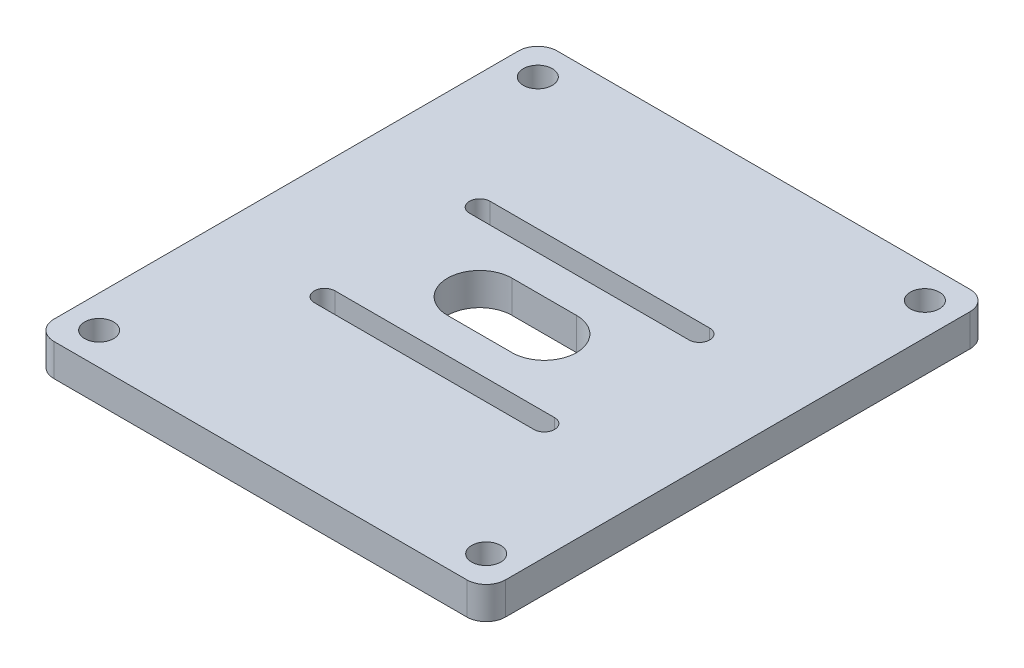
ISO-10303-21;
HEADER;
FILE_DESCRIPTION(('STEP AP214'),'2;1');
FILE_NAME('part.step','',(''),(''),'','','');
FILE_SCHEMA(('AUTOMOTIVE_DESIGN { 1 0 10303 214 1 1 1 1 }'));
ENDSEC;
DATA;
#1=APPLICATION_CONTEXT('core data for automotive mechanical design processes');
#2=APPLICATION_PROTOCOL_DEFINITION('international standard','automotive_design',2000,#1);
#3=PRODUCT_CONTEXT('',#1,'mechanical');
#4=PRODUCT('Part','Part','',(#3));
#5=PRODUCT_RELATED_PRODUCT_CATEGORY('part','',(#4));
#6=PRODUCT_DEFINITION_FORMATION('','',#4);
#7=PRODUCT_DEFINITION_CONTEXT('part definition',#1,'design');
#8=PRODUCT_DEFINITION('design','',#6,#7);
#9=PRODUCT_DEFINITION_SHAPE('','',#8);
#10=(LENGTH_UNIT() NAMED_UNIT(*) SI_UNIT(.MILLI.,.METRE.));
#11=(NAMED_UNIT(*) PLANE_ANGLE_UNIT() SI_UNIT($,.RADIAN.));
#12=(NAMED_UNIT(*) SI_UNIT($,.STERADIAN.) SOLID_ANGLE_UNIT());
#13=UNCERTAINTY_MEASURE_WITH_UNIT(LENGTH_MEASURE(1.E-05),#10,'distance_accuracy_value','');
#14=(GEOMETRIC_REPRESENTATION_CONTEXT(3) GLOBAL_UNCERTAINTY_ASSIGNED_CONTEXT((#13)) GLOBAL_UNIT_ASSIGNED_CONTEXT((#10,
#11,#12)) REPRESENTATION_CONTEXT('',''));
#15=CARTESIAN_POINT('',(0.,0.,0.));
#16=DIRECTION('',(0.,0.,1.));
#17=DIRECTION('',(1.,0.,0.));
#18=AXIS2_PLACEMENT_3D('',#15,#16,#17);
#19=CARTESIAN_POINT('',(0.,5.,10.4208152801713));
#20=DIRECTION('',(0.,0.,-1.));
#21=DIRECTION('',(-1.,0.,0.));
#22=AXIS2_PLACEMENT_3D('',#19,#20,#21);
#23=PLANE('',#22);
#24=DIRECTION('',(1.,0.,0.));
#25=VECTOR('',#24,1.);
#26=CARTESIAN_POINT('',(0.,0.,10.4208152801713));
#27=LINE('',#26,#25);
#28=CARTESIAN_POINT('',(-22.0208152801713,0.,10.4208152801713));
#29=VERTEX_POINT('',#28);
#30=CARTESIAN_POINT('',(12.0208152801713,0.,10.4208152801713));
#31=VERTEX_POINT('',#30);
#32=EDGE_CURVE('E321',#29,#31,#27,.T.);
#33=ORIENTED_EDGE('',*,*,#32,.T.);
#34=DIRECTION('',(0.,-1.,0.));
#35=VECTOR('',#34,1.);
#36=CARTESIAN_POINT('',(12.0208152801713,5.,10.4208152801713));
#37=LINE('',#36,#35);
#38=CARTESIAN_POINT('',(12.0208152801713,5.,10.4208152801713));
#39=VERTEX_POINT('',#38);
#40=EDGE_CURVE('E356',#39,#31,#37,.T.);
#41=ORIENTED_EDGE('',*,*,#40,.F.);
#42=DIRECTION('',(1.,0.,0.));
#43=VECTOR('',#42,1.);
#44=CARTESIAN_POINT('',(0.,5.,10.4208152801713));
#45=LINE('',#44,#43);
#46=CARTESIAN_POINT('',(-22.0208152801713,5.,10.4208152801713));
#47=VERTEX_POINT('',#46);
#48=EDGE_CURVE('E245',#47,#39,#45,.T.);
#49=ORIENTED_EDGE('',*,*,#48,.F.);
#50=DIRECTION('',(0.,-1.,0.));
#51=VECTOR('',#50,1.);
#52=CARTESIAN_POINT('',(-22.0208152801713,5.,10.4208152801713));
#53=LINE('',#52,#51);
#54=EDGE_CURVE('E345',#47,#29,#53,.T.);
#55=ORIENTED_EDGE('',*,*,#54,.T.);
#56=EDGE_LOOP('',(#33,#41,#49,#55));
#57=FACE_BOUND('',#56,.T.);
#58=ADVANCED_FACE('F39',(#57),#23,.F.);
#59=CARTESIAN_POINT('',(12.0208152801713,5.,12.0208152801713));
#60=DIRECTION('',(0.,-1.,0.));
#61=DIRECTION('',(0.,0.,-1.));
#62=AXIS2_PLACEMENT_3D('',#59,#60,#61);
#63=CYLINDRICAL_SURFACE('',#62,1.6);
#64=CARTESIAN_POINT('',(12.0208152801713,0.,12.0208152801713));
#65=DIRECTION('',(0.,1.,0.));
#66=DIRECTION('',(0.,0.,1.));
#67=AXIS2_PLACEMENT_3D('',#64,#65,#66);
#68=CIRCLE('',#67,1.6);
#69=CARTESIAN_POINT('',(12.0208152801713,0.,13.6208152801713));
#70=VERTEX_POINT('',#69);
#71=EDGE_CURVE('E325',#31,#70,#68,.F.);
#72=ORIENTED_EDGE('',*,*,#71,.T.);
#73=DIRECTION('',(0.,-1.,0.));
#74=VECTOR('',#73,1.);
#75=CARTESIAN_POINT('',(12.0208152801713,5.,13.6208152801713));
#76=LINE('',#75,#74);
#77=CARTESIAN_POINT('',(12.0208152801713,5.,13.6208152801713));
#78=VERTEX_POINT('',#77);
#79=EDGE_CURVE('E353',#78,#70,#76,.T.);
#80=ORIENTED_EDGE('',*,*,#79,.F.);
#81=CARTESIAN_POINT('',(12.0208152801713,5.,12.0208152801713));
#82=DIRECTION('',(0.,1.,0.));
#83=DIRECTION('',(0.,0.,1.));
#84=AXIS2_PLACEMENT_3D('',#81,#82,#83);
#85=CIRCLE('',#84,1.6);
#86=EDGE_CURVE('E249',#39,#78,#85,.F.);
#87=ORIENTED_EDGE('',*,*,#86,.F.);
#88=ORIENTED_EDGE('',*,*,#40,.T.);
#89=EDGE_LOOP('',(#72,#80,#87,#88));
#90=FACE_BOUND('',#89,.T.);
#91=ADVANCED_FACE('F461',(#90),#63,.F.);
#92=CARTESIAN_POINT('',(0.,5.,13.6208152801713));
#93=DIRECTION('',(0.,0.,-1.));
#94=DIRECTION('',(-1.,0.,0.));
#95=AXIS2_PLACEMENT_3D('',#92,#93,#94);
#96=PLANE('',#95);
#97=DIRECTION('',(1.,0.,0.));
#98=VECTOR('',#97,1.);
#99=CARTESIAN_POINT('',(0.,0.,13.6208152801713));
#100=LINE('',#99,#98);
#101=CARTESIAN_POINT('',(-22.0208152801713,0.,13.6208152801713));
#102=VERTEX_POINT('',#101);
#103=EDGE_CURVE('E329',#102,#70,#100,.T.);
#104=ORIENTED_EDGE('',*,*,#103,.F.);
#105=DIRECTION('',(0.,-1.,0.));
#106=VECTOR('',#105,1.);
#107=CARTESIAN_POINT('',(-22.0208152801713,5.,13.6208152801713));
#108=LINE('',#107,#106);
#109=CARTESIAN_POINT('',(-22.0208152801713,5.,13.6208152801713));
#110=VERTEX_POINT('',#109);
#111=EDGE_CURVE('E349',#110,#102,#108,.T.);
#112=ORIENTED_EDGE('',*,*,#111,.F.);
#113=DIRECTION('',(1.,0.,0.));
#114=VECTOR('',#113,1.);
#115=CARTESIAN_POINT('',(0.,5.,13.6208152801713));
#116=LINE('',#115,#114);
#117=EDGE_CURVE('E252',#110,#78,#116,.T.);
#118=ORIENTED_EDGE('',*,*,#117,.T.);
#119=ORIENTED_EDGE('',*,*,#79,.T.);
#120=EDGE_LOOP('',(#104,#112,#118,#119));
#121=FACE_BOUND('',#120,.T.);
#122=ADVANCED_FACE('F467',(#121),#96,.T.);
#123=CARTESIAN_POINT('',(0.,5.,-39.));
#124=DIRECTION('',(0.,0.,-1.));
#125=DIRECTION('',(-1.,0.,0.));
#126=AXIS2_PLACEMENT_3D('',#123,#124,#125);
#127=PLANE('',#126);
#128=DIRECTION('',(1.,0.,0.));
#129=VECTOR('',#128,1.);
#130=CARTESIAN_POINT('',(0.,5.,-39.));
#131=LINE('',#130,#129);
#132=CARTESIAN_POINT('',(-37.,5.,-39.));
#133=VERTEX_POINT('',#132);
#134=CARTESIAN_POINT('',(27.,5.,-39.));
#135=VERTEX_POINT('',#134);
#136=EDGE_CURVE('E231',#133,#135,#131,.T.);
#137=ORIENTED_EDGE('',*,*,#136,.T.);
#138=DIRECTION('',(0.,-1.,0.));
#139=VECTOR('',#138,1.);
#140=CARTESIAN_POINT('',(27.,5.,-39.));
#141=LINE('',#140,#139);
#142=CARTESIAN_POINT('',(27.,0.,-39.));
#143=VERTEX_POINT('',#142);
#144=EDGE_CURVE('E11',#135,#143,#141,.T.);
#145=ORIENTED_EDGE('',*,*,#144,.T.);
#146=DIRECTION('',(1.,0.,0.));
#147=VECTOR('',#146,1.);
#148=CARTESIAN_POINT('',(0.,0.,-39.));
#149=LINE('',#148,#147);
#150=CARTESIAN_POINT('',(-37.,0.,-39.));
#151=VERTEX_POINT('',#150);
#152=EDGE_CURVE('E305',#151,#143,#149,.T.);
#153=ORIENTED_EDGE('',*,*,#152,.F.);
#154=DIRECTION('',(0.,-1.,0.));
#155=VECTOR('',#154,1.);
#156=CARTESIAN_POINT('',(-37.,5.,-39.));
#157=LINE('',#156,#155);
#158=EDGE_CURVE('E48',#151,#133,#157,.F.);
#159=ORIENTED_EDGE('',*,*,#158,.T.);
#160=EDGE_LOOP('',(#137,#145,#153,#159));
#161=FACE_BOUND('',#160,.T.);
#162=ADVANCED_FACE('F424',(#161),#127,.T.);
#163=CARTESIAN_POINT('',(-40.,5.,0.));
#164=DIRECTION('',(1.,0.,0.));
#165=DIRECTION('',(0.,0.,-1.));
#166=AXIS2_PLACEMENT_3D('',#163,#164,#165);
#167=PLANE('',#166);
#168=DIRECTION('',(0.,0.,1.));
#169=VECTOR('',#168,1.);
#170=CARTESIAN_POINT('',(-40.,0.,0.));
#171=LINE('',#170,#169);
#172=CARTESIAN_POINT('',(-40.,0.,-36.));
#173=VERTEX_POINT('',#172);
#174=CARTESIAN_POINT('',(-40.,0.,36.));
#175=VERTEX_POINT('',#174);
#176=EDGE_CURVE('E309',#173,#175,#171,.T.);
#177=ORIENTED_EDGE('',*,*,#176,.T.);
#178=DIRECTION('',(0.,-1.,0.));
#179=VECTOR('',#178,1.);
#180=CARTESIAN_POINT('',(-40.,5.,36.));
#181=LINE('',#180,#179);
#182=CARTESIAN_POINT('',(-40.,5.,36.));
#183=VERTEX_POINT('',#182);
#184=EDGE_CURVE('E400',#175,#183,#181,.F.);
#185=ORIENTED_EDGE('',*,*,#184,.T.);
#186=DIRECTION('',(0.,0.,1.));
#187=VECTOR('',#186,1.);
#188=CARTESIAN_POINT('',(-40.,5.,0.));
#189=LINE('',#188,#187);
#190=CARTESIAN_POINT('',(-40.,5.,-36.));
#191=VERTEX_POINT('',#190);
#192=EDGE_CURVE('E235',#191,#183,#189,.T.);
#193=ORIENTED_EDGE('',*,*,#192,.F.);
#194=DIRECTION('',(0.,-1.,0.));
#195=VECTOR('',#194,1.);
#196=CARTESIAN_POINT('',(-40.,0.,-36.));
#197=LINE('',#196,#195);
#198=EDGE_CURVE('E396',#191,#173,#197,.T.);
#199=ORIENTED_EDGE('',*,*,#198,.T.);
#200=EDGE_LOOP('',(#177,#185,#193,#199));
#201=FACE_BOUND('',#200,.T.);
#202=ADVANCED_FACE('F434',(#201),#167,.F.);
#203=CARTESIAN_POINT('',(0.,5.,39.));
#204=DIRECTION('',(0.,0.,-1.));
#205=DIRECTION('',(-1.,0.,0.));
#206=AXIS2_PLACEMENT_3D('',#203,#204,#205);
#207=PLANE('',#206);
#208=DIRECTION('',(1.,0.,0.));
#209=VECTOR('',#208,1.);
#210=CARTESIAN_POINT('',(0.,5.,39.));
#211=LINE('',#210,#209);
#212=CARTESIAN_POINT('',(-37.,5.,39.));
#213=VERTEX_POINT('',#212);
#214=CARTESIAN_POINT('',(27.,5.,39.));
#215=VERTEX_POINT('',#214);
#216=EDGE_CURVE('E239',#213,#215,#211,.T.);
#217=ORIENTED_EDGE('',*,*,#216,.F.);
#218=DIRECTION('',(0.,-1.,0.));
#219=VECTOR('',#218,1.);
#220=CARTESIAN_POINT('',(-37.,5.,39.));
#221=LINE('',#220,#219);
#222=CARTESIAN_POINT('',(-37.,0.,39.));
#223=VERTEX_POINT('',#222);
#224=EDGE_CURVE('E380',#213,#223,#221,.T.);
#225=ORIENTED_EDGE('',*,*,#224,.T.);
#226=DIRECTION('',(1.,0.,0.));
#227=VECTOR('',#226,1.);
#228=CARTESIAN_POINT('',(0.,0.,39.));
#229=LINE('',#228,#227);
#230=CARTESIAN_POINT('',(27.,0.,39.));
#231=VERTEX_POINT('',#230);
#232=EDGE_CURVE('E313',#223,#231,#229,.T.);
#233=ORIENTED_EDGE('',*,*,#232,.T.);
#234=DIRECTION('',(0.,-1.,0.));
#235=VECTOR('',#234,1.);
#236=CARTESIAN_POINT('',(27.,5.,39.));
#237=LINE('',#236,#235);
#238=EDGE_CURVE('E360',#231,#215,#237,.F.);
#239=ORIENTED_EDGE('',*,*,#238,.T.);
#240=EDGE_LOOP('',(#217,#225,#233,#239));
#241=FACE_BOUND('',#240,.T.);
#242=ADVANCED_FACE('F446',(#241),#207,.F.);
#243=CARTESIAN_POINT('',(12.0208152801713,5.,-12.0208152801713));
#244=DIRECTION('',(0.,-1.,0.));
#245=DIRECTION('',(0.,0.,-1.));
#246=AXIS2_PLACEMENT_3D('',#243,#244,#245);
#247=CYLINDRICAL_SURFACE('',#246,1.6);
#248=CARTESIAN_POINT('',(12.0208152801713,0.,-12.0208152801713));
#249=DIRECTION('',(0.,1.,0.));
#250=DIRECTION('',(0.,0.,1.));
#251=AXIS2_PLACEMENT_3D('',#248,#249,#250);
#252=CIRCLE('',#251,1.6);
#253=CARTESIAN_POINT('',(12.0208152801713,0.,-10.4208152801713));
#254=VERTEX_POINT('',#253);
#255=CARTESIAN_POINT('',(12.0208152801713,0.,-13.6208152801713));
#256=VERTEX_POINT('',#255);
#257=EDGE_CURVE('E289',#254,#256,#252,.T.);
#258=ORIENTED_EDGE('',*,*,#257,.F.);
#259=DIRECTION('',(0.,-1.,0.));
#260=VECTOR('',#259,1.);
#261=CARTESIAN_POINT('',(12.0208152801713,5.,-10.4208152801713));
#262=LINE('',#261,#260);
#263=CARTESIAN_POINT('',(12.0208152801713,5.,-10.4208152801713));
#264=VERTEX_POINT('',#263);
#265=EDGE_CURVE('E350',#264,#254,#262,.T.);
#266=ORIENTED_EDGE('',*,*,#265,.F.);
#267=CARTESIAN_POINT('',(12.0208152801713,5.,-12.0208152801713));
#268=DIRECTION('',(0.,1.,0.));
#269=DIRECTION('',(0.,0.,1.));
#270=AXIS2_PLACEMENT_3D('',#267,#268,#269);
#271=CIRCLE('',#270,1.6);
#272=CARTESIAN_POINT('',(12.0208152801713,5.,-13.6208152801713));
#273=VERTEX_POINT('',#272);
#274=EDGE_CURVE('E216',#264,#273,#271,.T.);
#275=ORIENTED_EDGE('',*,*,#274,.T.);
#276=DIRECTION('',(0.,-1.,0.));
#277=VECTOR('',#276,1.);
#278=CARTESIAN_POINT('',(12.0208152801713,5.,-13.6208152801713));
#279=LINE('',#278,#277);
#280=EDGE_CURVE('E190',#273,#256,#279,.T.);
#281=ORIENTED_EDGE('',*,*,#280,.T.);
#282=EDGE_LOOP('',(#258,#266,#275,#281));
#283=FACE_BOUND('',#282,.T.);
#284=ADVANCED_FACE('F478',(#283),#247,.F.);
#285=CARTESIAN_POINT('',(0.,5.,-10.4208152801713));
#286=DIRECTION('',(0.,0.,-1.));
#287=DIRECTION('',(-1.,0.,0.));
#288=AXIS2_PLACEMENT_3D('',#285,#286,#287);
#289=PLANE('',#288);
#290=DIRECTION('',(1.,0.,0.));
#291=VECTOR('',#290,1.);
#292=CARTESIAN_POINT('',(0.,0.,-10.4208152801713));
#293=LINE('',#292,#291);
#294=CARTESIAN_POINT('',(-22.0208152801713,0.,-10.4208152801713));
#295=VERTEX_POINT('',#294);
#296=EDGE_CURVE('E293',#295,#254,#293,.T.);
#297=ORIENTED_EDGE('',*,*,#296,.F.);
#298=DIRECTION('',(0.,-1.,0.));
#299=VECTOR('',#298,1.);
#300=CARTESIAN_POINT('',(-22.0208152801713,5.,-10.4208152801713));
#301=LINE('',#300,#299);
#302=CARTESIAN_POINT('',(-22.0208152801713,5.,-10.4208152801713));
#303=VERTEX_POINT('',#302);
#304=EDGE_CURVE('E366',#303,#295,#301,.T.);
#305=ORIENTED_EDGE('',*,*,#304,.F.);
#306=DIRECTION('',(1.,0.,0.));
#307=VECTOR('',#306,1.);
#308=CARTESIAN_POINT('',(0.,5.,-10.4208152801713));
#309=LINE('',#308,#307);
#310=EDGE_CURVE('E220',#303,#264,#309,.T.);
#311=ORIENTED_EDGE('',*,*,#310,.T.);
#312=ORIENTED_EDGE('',*,*,#265,.T.);
#313=EDGE_LOOP('',(#297,#305,#311,#312));
#314=FACE_BOUND('',#313,.T.);
#315=ADVANCED_FACE('F490',(#314),#289,.T.);
#316=CARTESIAN_POINT('',(-22.0208152801713,5.,-12.0208152801713));
#317=DIRECTION('',(0.,-1.,0.));
#318=DIRECTION('',(0.,0.,-1.));
#319=AXIS2_PLACEMENT_3D('',#316,#317,#318);
#320=CYLINDRICAL_SURFACE('',#319,1.6);
#321=CARTESIAN_POINT('',(-22.0208152801713,0.,-12.0208152801713));
#322=DIRECTION('',(0.,1.,0.));
#323=DIRECTION('',(0.,0.,1.));
#324=AXIS2_PLACEMENT_3D('',#321,#322,#323);
#325=CIRCLE('',#324,1.6);
#326=CARTESIAN_POINT('',(-22.0208152801713,0.,-13.6208152801713));
#327=VERTEX_POINT('',#326);
#328=EDGE_CURVE('E297',#327,#295,#325,.T.);
#329=ORIENTED_EDGE('',*,*,#328,.F.);
#330=DIRECTION('',(0.,-1.,0.));
#331=VECTOR('',#330,1.);
#332=CARTESIAN_POINT('',(-22.0208152801713,5.,-13.6208152801713));
#333=LINE('',#332,#331);
#334=CARTESIAN_POINT('',(-22.0208152801713,5.,-13.6208152801713));
#335=VERTEX_POINT('',#334);
#336=EDGE_CURVE('E363',#335,#327,#333,.T.);
#337=ORIENTED_EDGE('',*,*,#336,.F.);
#338=CARTESIAN_POINT('',(-22.0208152801713,5.,-12.0208152801713));
#339=DIRECTION('',(0.,1.,0.));
#340=DIRECTION('',(0.,0.,1.));
#341=AXIS2_PLACEMENT_3D('',#338,#339,#340);
#342=CIRCLE('',#341,1.6);
#343=EDGE_CURVE('E224',#335,#303,#342,.T.);
#344=ORIENTED_EDGE('',*,*,#343,.T.);
#345=ORIENTED_EDGE('',*,*,#304,.T.);
#346=EDGE_LOOP('',(#329,#337,#344,#345));
#347=FACE_BOUND('',#346,.T.);
#348=ADVANCED_FACE('F487',(#347),#320,.F.);
#349=CARTESIAN_POINT('',(0.,5.,0.));
#350=DIRECTION('',(0.,-1.,0.));
#351=DIRECTION('',(0.,0.,-1.));
#352=AXIS2_PLACEMENT_3D('',#349,#350,#351);
#353=CYLINDRICAL_SURFACE('',#352,5.);
#354=CARTESIAN_POINT('',(0.,0.,0.));
#355=DIRECTION('',(0.,1.,0.));
#356=DIRECTION('',(0.,0.,1.));
#357=AXIS2_PLACEMENT_3D('',#354,#355,#356);
#358=CIRCLE('',#357,5.);
#359=CARTESIAN_POINT('',(0.,0.,5.));
#360=VERTEX_POINT('',#359);
#361=CARTESIAN_POINT('',(0.,0.,-5.));
#362=VERTEX_POINT('',#361);
#363=EDGE_CURVE('E184',#360,#362,#358,.T.);
#364=ORIENTED_EDGE('',*,*,#363,.F.);
#365=DIRECTION('',(0.,-1.,0.));
#366=VECTOR('',#365,1.);
#367=CARTESIAN_POINT('',(0.,5.,5.));
#368=LINE('',#367,#366);
#369=CARTESIAN_POINT('',(0.,5.,5.));
#370=VERTEX_POINT('',#369);
#371=EDGE_CURVE('E179',#370,#360,#368,.T.);
#372=ORIENTED_EDGE('',*,*,#371,.F.);
#373=CARTESIAN_POINT('',(0.,5.,0.));
#374=DIRECTION('',(0.,1.,0.));
#375=DIRECTION('',(0.,0.,1.));
#376=AXIS2_PLACEMENT_3D('',#373,#374,#375);
#377=CIRCLE('',#376,5.);
#378=CARTESIAN_POINT('',(0.,5.,-5.));
#379=VERTEX_POINT('',#378);
#380=EDGE_CURVE('E182',#370,#379,#377,.T.);
#381=ORIENTED_EDGE('',*,*,#380,.T.);
#382=DIRECTION('',(0.,-1.,0.));
#383=VECTOR('',#382,1.);
#384=CARTESIAN_POINT('',(0.,5.,-5.));
#385=LINE('',#384,#383);
#386=EDGE_CURVE('E267',#379,#362,#385,.T.);
#387=ORIENTED_EDGE('',*,*,#386,.T.);
#388=EDGE_LOOP('',(#364,#372,#381,#387));
#389=FACE_BOUND('',#388,.T.);
#390=ADVANCED_FACE('F181',(#389),#353,.F.);
#391=CARTESIAN_POINT('',(0.,5.,5.));
#392=DIRECTION('',(0.,0.,-1.));
#393=DIRECTION('',(-1.,0.,0.));
#394=AXIS2_PLACEMENT_3D('',#391,#392,#393);
#395=PLANE('',#394);
#396=DIRECTION('',(1.,0.,0.));
#397=VECTOR('',#396,1.);
#398=CARTESIAN_POINT('',(0.,0.,5.));
#399=LINE('',#398,#397);
#400=CARTESIAN_POINT('',(-10.,0.,5.));
#401=VERTEX_POINT('',#400);
#402=EDGE_CURVE('E278',#401,#360,#399,.T.);
#403=ORIENTED_EDGE('',*,*,#402,.F.);
#404=DIRECTION('',(0.,-1.,0.));
#405=VECTOR('',#404,1.);
#406=CARTESIAN_POINT('',(-10.,5.,5.));
#407=LINE('',#406,#405);
#408=CARTESIAN_POINT('',(-10.,5.,5.));
#409=VERTEX_POINT('',#408);
#410=EDGE_CURVE('E191',#409,#401,#407,.T.);
#411=ORIENTED_EDGE('',*,*,#410,.F.);
#412=DIRECTION('',(1.,0.,0.));
#413=VECTOR('',#412,1.);
#414=CARTESIAN_POINT('',(0.,5.,5.));
#415=LINE('',#414,#413);
#416=EDGE_CURVE('E198',#409,#370,#415,.T.);
#417=ORIENTED_EDGE('',*,*,#416,.T.);
#418=ORIENTED_EDGE('',*,*,#371,.T.);
#419=EDGE_LOOP('',(#403,#411,#417,#418));
#420=FACE_BOUND('',#419,.T.);
#421=ADVANCED_FACE('F206',(#420),#395,.T.);
#422=CARTESIAN_POINT('',(-10.,5.,0.));
#423=DIRECTION('',(0.,-1.,0.));
#424=DIRECTION('',(0.,0.,-1.));
#425=AXIS2_PLACEMENT_3D('',#422,#423,#424);
#426=CYLINDRICAL_SURFACE('',#425,5.);
#427=CARTESIAN_POINT('',(-10.,0.,0.));
#428=DIRECTION('',(0.,1.,0.));
#429=DIRECTION('',(0.,0.,1.));
#430=AXIS2_PLACEMENT_3D('',#427,#428,#429);
#431=CIRCLE('',#430,5.);
#432=CARTESIAN_POINT('',(-10.,0.,-5.));
#433=VERTEX_POINT('',#432);
#434=EDGE_CURVE('E281',#433,#401,#431,.T.);
#435=ORIENTED_EDGE('',*,*,#434,.F.);
#436=DIRECTION('',(0.,-1.,0.));
#437=VECTOR('',#436,1.);
#438=CARTESIAN_POINT('',(-10.,5.,-5.));
#439=LINE('',#438,#437);
#440=CARTESIAN_POINT('',(-10.,5.,-5.));
#441=VERTEX_POINT('',#440);
#442=EDGE_CURVE('E373',#441,#433,#439,.T.);
#443=ORIENTED_EDGE('',*,*,#442,.F.);
#444=CARTESIAN_POINT('',(-10.,5.,0.));
#445=DIRECTION('',(0.,1.,0.));
#446=DIRECTION('',(0.,0.,1.));
#447=AXIS2_PLACEMENT_3D('',#444,#445,#446);
#448=CIRCLE('',#447,5.);
#449=EDGE_CURVE('E208',#441,#409,#448,.T.);
#450=ORIENTED_EDGE('',*,*,#449,.T.);
#451=ORIENTED_EDGE('',*,*,#410,.T.);
#452=EDGE_LOOP('',(#435,#443,#450,#451));
#453=FACE_BOUND('',#452,.T.);
#454=ADVANCED_FACE('F502',(#453),#426,.F.);
#455=CARTESIAN_POINT('',(25.,5.,34.));
#456=DIRECTION('',(0.,-1.,0.));
#457=DIRECTION('',(0.,0.,-1.));
#458=AXIS2_PLACEMENT_3D('',#455,#456,#457);
#459=CYLINDRICAL_SURFACE('',#458,2.25);
#460=CARTESIAN_POINT('',(25.,5.,34.));
#461=DIRECTION('',(0.,1.,0.));
#462=DIRECTION('',(0.,0.,1.));
#463=AXIS2_PLACEMENT_3D('',#460,#461,#462);
#464=CIRCLE('',#463,2.25);
#465=CARTESIAN_POINT('',(25.,5.,36.25));
#466=VERTEX_POINT('',#465);
#467=EDGE_CURVE('E259',#466,#466,#464,.T.);
#468=ORIENTED_EDGE('',*,*,#467,.T.);
#469=EDGE_LOOP('',(#468));
#470=FACE_BOUND('',#469,.T.);
#471=CARTESIAN_POINT('',(25.,0.,34.));
#472=DIRECTION('',(0.,1.,0.));
#473=DIRECTION('',(0.,0.,1.));
#474=AXIS2_PLACEMENT_3D('',#471,#472,#473);
#475=CIRCLE('',#474,2.25);
#476=CARTESIAN_POINT('',(25.,0.,36.25));
#477=VERTEX_POINT('',#476);
#478=EDGE_CURVE('E336',#477,#477,#475,.T.);
#479=ORIENTED_EDGE('',*,*,#478,.F.);
#480=EDGE_LOOP('',(#479));
#481=FACE_BOUND('',#480,.T.);
#482=ADVANCED_FACE('F505',(#470,#481),#459,.F.);
#483=CARTESIAN_POINT('',(-22.0208152801713,5.,12.0208152801713));
#484=DIRECTION('',(0.,-1.,0.));
#485=DIRECTION('',(0.,0.,-1.));
#486=AXIS2_PLACEMENT_3D('',#483,#484,#485);
#487=CYLINDRICAL_SURFACE('',#486,1.6);
#488=CARTESIAN_POINT('',(-22.0208152801713,0.,12.0208152801713));
#489=DIRECTION('',(0.,1.,0.));
#490=DIRECTION('',(0.,0.,1.));
#491=AXIS2_PLACEMENT_3D('',#488,#489,#490);
#492=CIRCLE('',#491,1.6);
#493=EDGE_CURVE('E333',#102,#29,#492,.F.);
#494=ORIENTED_EDGE('',*,*,#493,.T.);
#495=ORIENTED_EDGE('',*,*,#54,.F.);
#496=CARTESIAN_POINT('',(-22.0208152801713,5.,12.0208152801713));
#497=DIRECTION('',(0.,1.,0.));
#498=DIRECTION('',(0.,0.,1.));
#499=AXIS2_PLACEMENT_3D('',#496,#497,#498);
#500=CIRCLE('',#499,1.6);
#501=EDGE_CURVE('E256',#110,#47,#500,.F.);
#502=ORIENTED_EDGE('',*,*,#501,.F.);
#503=ORIENTED_EDGE('',*,*,#111,.T.);
#504=EDGE_LOOP('',(#494,#495,#502,#503));
#505=FACE_BOUND('',#504,.T.);
#506=ADVANCED_FACE('F475',(#505),#487,.F.);
#507=CARTESIAN_POINT('',(30.,5.,0.));
#508=DIRECTION('',(1.,0.,0.));
#509=DIRECTION('',(0.,0.,-1.));
#510=AXIS2_PLACEMENT_3D('',#507,#508,#509);
#511=PLANE('',#510);
#512=DIRECTION('',(0.,0.,1.));
#513=VECTOR('',#512,1.);
#514=CARTESIAN_POINT('',(30.,5.,0.));
#515=LINE('',#514,#513);
#516=CARTESIAN_POINT('',(30.,5.,-36.));
#517=VERTEX_POINT('',#516);
#518=CARTESIAN_POINT('',(30.,5.,36.));
#519=VERTEX_POINT('',#518);
#520=EDGE_CURVE('E242',#517,#519,#515,.T.);
#521=ORIENTED_EDGE('',*,*,#520,.T.);
#522=DIRECTION('',(0.,-1.,0.));
#523=VECTOR('',#522,1.);
#524=CARTESIAN_POINT('',(30.,0.,36.));
#525=LINE('',#524,#523);
#526=CARTESIAN_POINT('',(30.,0.,36.));
#527=VERTEX_POINT('',#526);
#528=EDGE_CURVE('E416',#519,#527,#525,.T.);
#529=ORIENTED_EDGE('',*,*,#528,.T.);
#530=DIRECTION('',(0.,0.,1.));
#531=VECTOR('',#530,1.);
#532=CARTESIAN_POINT('',(30.,0.,0.));
#533=LINE('',#532,#531);
#534=CARTESIAN_POINT('',(30.,0.,-36.));
#535=VERTEX_POINT('',#534);
#536=EDGE_CURVE('E317',#535,#527,#533,.T.);
#537=ORIENTED_EDGE('',*,*,#536,.F.);
#538=DIRECTION('',(0.,-1.,0.));
#539=VECTOR('',#538,1.);
#540=CARTESIAN_POINT('',(30.,5.,-36.));
#541=LINE('',#540,#539);
#542=EDGE_CURVE('E62',#535,#517,#541,.F.);
#543=ORIENTED_EDGE('',*,*,#542,.T.);
#544=EDGE_LOOP('',(#521,#529,#537,#543));
#545=FACE_BOUND('',#544,.T.);
#546=ADVANCED_FACE('F451',(#545),#511,.T.);
#547=CARTESIAN_POINT('',(0.,5.,-13.6208152801713));
#548=DIRECTION('',(0.,0.,-1.));
#549=DIRECTION('',(-1.,0.,0.));
#550=AXIS2_PLACEMENT_3D('',#547,#548,#549);
#551=PLANE('',#550);
#552=DIRECTION('',(1.,0.,0.));
#553=VECTOR('',#552,1.);
#554=CARTESIAN_POINT('',(0.,0.,-13.6208152801713));
#555=LINE('',#554,#553);
#556=EDGE_CURVE('E301',#327,#256,#555,.T.);
#557=ORIENTED_EDGE('',*,*,#556,.T.);
#558=ORIENTED_EDGE('',*,*,#280,.F.);
#559=DIRECTION('',(1.,0.,0.));
#560=VECTOR('',#559,1.);
#561=CARTESIAN_POINT('',(0.,5.,-13.6208152801713));
#562=LINE('',#561,#560);
#563=EDGE_CURVE('E228',#335,#273,#562,.T.);
#564=ORIENTED_EDGE('',*,*,#563,.F.);
#565=ORIENTED_EDGE('',*,*,#336,.T.);
#566=EDGE_LOOP('',(#557,#558,#564,#565));
#567=FACE_BOUND('',#566,.T.);
#568=ADVANCED_FACE('F474',(#567),#551,.F.);
#569=CARTESIAN_POINT('',(0.,5.,-5.));
#570=DIRECTION('',(0.,0.,-1.));
#571=DIRECTION('',(-1.,0.,0.));
#572=AXIS2_PLACEMENT_3D('',#569,#570,#571);
#573=PLANE('',#572);
#574=DIRECTION('',(1.,0.,0.));
#575=VECTOR('',#574,1.);
#576=CARTESIAN_POINT('',(0.,0.,-5.));
#577=LINE('',#576,#575);
#578=EDGE_CURVE('E285',#433,#362,#577,.T.);
#579=ORIENTED_EDGE('',*,*,#578,.T.);
#580=ORIENTED_EDGE('',*,*,#386,.F.);
#581=DIRECTION('',(1.,0.,0.));
#582=VECTOR('',#581,1.);
#583=CARTESIAN_POINT('',(0.,5.,-5.));
#584=LINE('',#583,#582);
#585=EDGE_CURVE('E201',#441,#379,#584,.T.);
#586=ORIENTED_EDGE('',*,*,#585,.F.);
#587=ORIENTED_EDGE('',*,*,#442,.T.);
#588=EDGE_LOOP('',(#579,#580,#586,#587));
#589=FACE_BOUND('',#588,.T.);
#590=ADVANCED_FACE('F485',(#589),#573,.F.);
#591=CARTESIAN_POINT('',(-35.,5.,-34.));
#592=DIRECTION('',(0.,-1.,0.));
#593=DIRECTION('',(0.,0.,-1.));
#594=AXIS2_PLACEMENT_3D('',#591,#592,#593);
#595=CYLINDRICAL_SURFACE('',#594,2.25);
#596=CARTESIAN_POINT('',(-35.,5.,-34.));
#597=DIRECTION('',(0.,1.,0.));
#598=DIRECTION('',(0.,0.,1.));
#599=AXIS2_PLACEMENT_3D('',#596,#597,#598);
#600=CIRCLE('',#599,2.25);
#601=CARTESIAN_POINT('',(-35.,5.,-31.75));
#602=VERTEX_POINT('',#601);
#603=EDGE_CURVE('E204',#602,#602,#600,.T.);
#604=ORIENTED_EDGE('',*,*,#603,.T.);
#605=EDGE_LOOP('',(#604));
#606=FACE_BOUND('',#605,.T.);
#607=CARTESIAN_POINT('',(-35.,0.,-34.));
#608=DIRECTION('',(0.,1.,0.));
#609=DIRECTION('',(0.,0.,1.));
#610=AXIS2_PLACEMENT_3D('',#607,#608,#609);
#611=CIRCLE('',#610,2.25);
#612=CARTESIAN_POINT('',(-35.,0.,-31.75));
#613=VERTEX_POINT('',#612);
#614=EDGE_CURVE('E272',#613,#613,#611,.T.);
#615=ORIENTED_EDGE('',*,*,#614,.F.);
#616=EDGE_LOOP('',(#615));
#617=FACE_BOUND('',#616,.T.);
#618=ADVANCED_FACE('F500',(#606,#617),#595,.F.);
#619=CARTESIAN_POINT('',(25.,5.,-34.));
#620=DIRECTION('',(0.,-1.,0.));
#621=DIRECTION('',(0.,0.,-1.));
#622=AXIS2_PLACEMENT_3D('',#619,#620,#621);
#623=CYLINDRICAL_SURFACE('',#622,2.25);
#624=CARTESIAN_POINT('',(25.,5.,-34.));
#625=DIRECTION('',(0.,1.,0.));
#626=DIRECTION('',(0.,0.,1.));
#627=AXIS2_PLACEMENT_3D('',#624,#625,#626);
#628=CIRCLE('',#627,2.25);
#629=CARTESIAN_POINT('',(25.,5.,-31.75));
#630=VERTEX_POINT('',#629);
#631=EDGE_CURVE('E344',#630,#630,#628,.F.);
#632=ORIENTED_EDGE('',*,*,#631,.F.);
#633=EDGE_LOOP('',(#632));
#634=FACE_BOUND('',#633,.T.);
#635=CARTESIAN_POINT('',(25.,0.,-34.));
#636=DIRECTION('',(0.,1.,0.));
#637=DIRECTION('',(0.,0.,1.));
#638=AXIS2_PLACEMENT_3D('',#635,#636,#637);
#639=CIRCLE('',#638,2.25);
#640=CARTESIAN_POINT('',(25.,0.,-31.75));
#641=VERTEX_POINT('',#640);
#642=EDGE_CURVE('E268',#641,#641,#639,.F.);
#643=ORIENTED_EDGE('',*,*,#642,.T.);
#644=EDGE_LOOP('',(#643));
#645=FACE_BOUND('',#644,.T.);
#646=ADVANCED_FACE('F513',(#634,#645),#623,.F.);
#647=CARTESIAN_POINT('',(-35.,5.,34.));
#648=DIRECTION('',(0.,-1.,0.));
#649=DIRECTION('',(0.,0.,-1.));
#650=AXIS2_PLACEMENT_3D('',#647,#648,#649);
#651=CYLINDRICAL_SURFACE('',#650,2.25);
#652=CARTESIAN_POINT('',(-35.,5.,34.));
#653=DIRECTION('',(0.,1.,0.));
#654=DIRECTION('',(0.,0.,1.));
#655=AXIS2_PLACEMENT_3D('',#652,#653,#654);
#656=CIRCLE('',#655,2.25);
#657=CARTESIAN_POINT('',(-35.,5.,36.25));
#658=VERTEX_POINT('',#657);
#659=EDGE_CURVE('E263',#658,#658,#656,.F.);
#660=ORIENTED_EDGE('',*,*,#659,.F.);
#661=EDGE_LOOP('',(#660));
#662=FACE_BOUND('',#661,.T.);
#663=CARTESIAN_POINT('',(-35.,0.,34.));
#664=DIRECTION('',(0.,1.,0.));
#665=DIRECTION('',(0.,0.,1.));
#666=AXIS2_PLACEMENT_3D('',#663,#664,#665);
#667=CIRCLE('',#666,2.25);
#668=CARTESIAN_POINT('',(-35.,0.,36.25));
#669=VERTEX_POINT('',#668);
#670=EDGE_CURVE('E340',#669,#669,#667,.F.);
#671=ORIENTED_EDGE('',*,*,#670,.T.);
#672=EDGE_LOOP('',(#671));
#673=FACE_BOUND('',#672,.T.);
#674=ADVANCED_FACE('F517',(#662,#673),#651,.F.);
#675=CARTESIAN_POINT('',(0.,5.,0.));
#676=DIRECTION('',(0.,1.,0.));
#677=DIRECTION('',(0.,0.,1.));
#678=AXIS2_PLACEMENT_3D('',#675,#676,#677);
#679=PLANE('',#678);
#680=ORIENTED_EDGE('',*,*,#631,.T.);
#681=EDGE_LOOP('',(#680));
#682=FACE_BOUND('',#681,.T.);
#683=ORIENTED_EDGE('',*,*,#603,.F.);
#684=EDGE_LOOP('',(#683));
#685=FACE_BOUND('',#684,.T.);
#686=ORIENTED_EDGE('',*,*,#380,.F.);
#687=ORIENTED_EDGE('',*,*,#416,.F.);
#688=ORIENTED_EDGE('',*,*,#449,.F.);
#689=ORIENTED_EDGE('',*,*,#585,.T.);
#690=EDGE_LOOP('',(#686,#687,#688,#689));
#691=FACE_BOUND('',#690,.T.);
#692=ORIENTED_EDGE('',*,*,#274,.F.);
#693=ORIENTED_EDGE('',*,*,#310,.F.);
#694=ORIENTED_EDGE('',*,*,#343,.F.);
#695=ORIENTED_EDGE('',*,*,#563,.T.);
#696=EDGE_LOOP('',(#692,#693,#694,#695));
#697=FACE_BOUND('',#696,.T.);
#698=ORIENTED_EDGE('',*,*,#192,.T.);
#699=CARTESIAN_POINT('',(-37.,5.,36.));
#700=DIRECTION('',(0.,1.,0.));
#701=DIRECTION('',(0.,0.,1.));
#702=AXIS2_PLACEMENT_3D('',#699,#700,#701);
#703=CIRCLE('',#702,3.);
#704=EDGE_CURVE('E411',#183,#213,#703,.T.);
#705=ORIENTED_EDGE('',*,*,#704,.T.);
#706=ORIENTED_EDGE('',*,*,#216,.T.);
#707=CARTESIAN_POINT('',(27.,5.,36.));
#708=DIRECTION('',(0.,1.,0.));
#709=DIRECTION('',(0.,0.,1.));
#710=AXIS2_PLACEMENT_3D('',#707,#708,#709);
#711=CIRCLE('',#710,3.);
#712=EDGE_CURVE('E55',#215,#519,#711,.T.);
#713=ORIENTED_EDGE('',*,*,#712,.T.);
#714=ORIENTED_EDGE('',*,*,#520,.F.);
#715=CARTESIAN_POINT('',(27.,5.,-36.));
#716=DIRECTION('',(0.,1.,0.));
#717=DIRECTION('',(0.,0.,1.));
#718=AXIS2_PLACEMENT_3D('',#715,#716,#717);
#719=CIRCLE('',#718,3.);
#720=EDGE_CURVE('E406',#517,#135,#719,.T.);
#721=ORIENTED_EDGE('',*,*,#720,.T.);
#722=ORIENTED_EDGE('',*,*,#136,.F.);
#723=CARTESIAN_POINT('',(-37.,5.,-36.));
#724=DIRECTION('',(0.,1.,0.));
#725=DIRECTION('',(0.,0.,1.));
#726=AXIS2_PLACEMENT_3D('',#723,#724,#725);
#727=CIRCLE('',#726,3.);
#728=EDGE_CURVE('E403',#133,#191,#727,.T.);
#729=ORIENTED_EDGE('',*,*,#728,.T.);
#730=EDGE_LOOP('',(#698,#705,#706,#713,#714,#721,#722,#729));
#731=FACE_BOUND('',#730,.T.);
#732=ORIENTED_EDGE('',*,*,#48,.T.);
#733=ORIENTED_EDGE('',*,*,#86,.T.);
#734=ORIENTED_EDGE('',*,*,#117,.F.);
#735=ORIENTED_EDGE('',*,*,#501,.T.);
#736=EDGE_LOOP('',(#732,#733,#734,#735));
#737=FACE_BOUND('',#736,.T.);
#738=ORIENTED_EDGE('',*,*,#467,.F.);
#739=EDGE_LOOP('',(#738));
#740=FACE_BOUND('',#739,.T.);
#741=ORIENTED_EDGE('',*,*,#659,.T.);
#742=EDGE_LOOP('',(#741));
#743=FACE_BOUND('',#742,.T.);
#744=ADVANCED_FACE('F195',(#682,#685,#691,#697,#731,#737,#740,#743),#679,.T.);
#745=CARTESIAN_POINT('',(0.,0.,0.));
#746=DIRECTION('',(0.,1.,0.));
#747=DIRECTION('',(0.,0.,1.));
#748=AXIS2_PLACEMENT_3D('',#745,#746,#747);
#749=PLANE('',#748);
#750=ORIENTED_EDGE('',*,*,#642,.F.);
#751=EDGE_LOOP('',(#750));
#752=FACE_BOUND('',#751,.T.);
#753=ORIENTED_EDGE('',*,*,#614,.T.);
#754=EDGE_LOOP('',(#753));
#755=FACE_BOUND('',#754,.T.);
#756=ORIENTED_EDGE('',*,*,#363,.T.);
#757=ORIENTED_EDGE('',*,*,#578,.F.);
#758=ORIENTED_EDGE('',*,*,#434,.T.);
#759=ORIENTED_EDGE('',*,*,#402,.T.);
#760=EDGE_LOOP('',(#756,#757,#758,#759));
#761=FACE_BOUND('',#760,.T.);
#762=ORIENTED_EDGE('',*,*,#257,.T.);
#763=ORIENTED_EDGE('',*,*,#556,.F.);
#764=ORIENTED_EDGE('',*,*,#328,.T.);
#765=ORIENTED_EDGE('',*,*,#296,.T.);
#766=EDGE_LOOP('',(#762,#763,#764,#765));
#767=FACE_BOUND('',#766,.T.);
#768=ORIENTED_EDGE('',*,*,#232,.F.);
#769=CARTESIAN_POINT('',(-37.,0.,36.));
#770=DIRECTION('',(0.,1.,0.));
#771=DIRECTION('',(0.,0.,1.));
#772=AXIS2_PLACEMENT_3D('',#769,#770,#771);
#773=CIRCLE('',#772,3.);
#774=EDGE_CURVE('E393',#223,#175,#773,.F.);
#775=ORIENTED_EDGE('',*,*,#774,.T.);
#776=ORIENTED_EDGE('',*,*,#176,.F.);
#777=CARTESIAN_POINT('',(-37.,0.,-36.));
#778=DIRECTION('',(0.,1.,0.));
#779=DIRECTION('',(0.,0.,1.));
#780=AXIS2_PLACEMENT_3D('',#777,#778,#779);
#781=CIRCLE('',#780,3.);
#782=EDGE_CURVE('E384',#173,#151,#781,.F.);
#783=ORIENTED_EDGE('',*,*,#782,.T.);
#784=ORIENTED_EDGE('',*,*,#152,.T.);
#785=CARTESIAN_POINT('',(27.,0.,-36.));
#786=DIRECTION('',(0.,1.,0.));
#787=DIRECTION('',(0.,0.,1.));
#788=AXIS2_PLACEMENT_3D('',#785,#786,#787);
#789=CIRCLE('',#788,3.);
#790=EDGE_CURVE('E387',#143,#535,#789,.F.);
#791=ORIENTED_EDGE('',*,*,#790,.T.);
#792=ORIENTED_EDGE('',*,*,#536,.T.);
#793=CARTESIAN_POINT('',(27.,0.,36.));
#794=DIRECTION('',(0.,1.,0.));
#795=DIRECTION('',(0.,0.,1.));
#796=AXIS2_PLACEMENT_3D('',#793,#794,#795);
#797=CIRCLE('',#796,3.);
#798=EDGE_CURVE('E390',#527,#231,#797,.F.);
#799=ORIENTED_EDGE('',*,*,#798,.T.);
#800=EDGE_LOOP('',(#768,#775,#776,#783,#784,#791,#792,#799));
#801=FACE_BOUND('',#800,.T.);
#802=ORIENTED_EDGE('',*,*,#32,.F.);
#803=ORIENTED_EDGE('',*,*,#493,.F.);
#804=ORIENTED_EDGE('',*,*,#103,.T.);
#805=ORIENTED_EDGE('',*,*,#71,.F.);
#806=EDGE_LOOP('',(#802,#803,#804,#805));
#807=FACE_BOUND('',#806,.T.);
#808=ORIENTED_EDGE('',*,*,#478,.T.);
#809=EDGE_LOOP('',(#808));
#810=FACE_BOUND('',#809,.T.);
#811=ORIENTED_EDGE('',*,*,#670,.F.);
#812=EDGE_LOOP('',(#811));
#813=FACE_BOUND('',#812,.T.);
#814=ADVANCED_FACE('F438',(#752,#755,#761,#767,#801,#807,#810,#813),#749,.F.);
#815=CARTESIAN_POINT('',(-37.,5.,36.));
#816=DIRECTION('',(0.,-1.,0.));
#817=DIRECTION('',(0.,0.,-1.));
#818=AXIS2_PLACEMENT_3D('',#815,#816,#817);
#819=CYLINDRICAL_SURFACE('',#818,3.);
#820=ORIENTED_EDGE('',*,*,#704,.F.);
#821=ORIENTED_EDGE('',*,*,#184,.F.);
#822=ORIENTED_EDGE('',*,*,#774,.F.);
#823=ORIENTED_EDGE('',*,*,#224,.F.);
#824=EDGE_LOOP('',(#820,#821,#822,#823));
#825=FACE_BOUND('',#824,.T.);
#826=ADVANCED_FACE('F443',(#825),#819,.T.);
#827=CARTESIAN_POINT('',(27.,5.,36.));
#828=DIRECTION('',(0.,1.,0.));
#829=DIRECTION('',(0.,0.,1.));
#830=AXIS2_PLACEMENT_3D('',#827,#828,#829);
#831=CYLINDRICAL_SURFACE('',#830,3.);
#832=ORIENTED_EDGE('',*,*,#712,.F.);
#833=ORIENTED_EDGE('',*,*,#238,.F.);
#834=ORIENTED_EDGE('',*,*,#798,.F.);
#835=ORIENTED_EDGE('',*,*,#528,.F.);
#836=EDGE_LOOP('',(#832,#833,#834,#835));
#837=FACE_BOUND('',#836,.T.);
#838=ADVANCED_FACE('F450',(#837),#831,.T.);
#839=CARTESIAN_POINT('',(27.,5.,-36.));
#840=DIRECTION('',(0.,-1.,0.));
#841=DIRECTION('',(0.,0.,-1.));
#842=AXIS2_PLACEMENT_3D('',#839,#840,#841);
#843=CYLINDRICAL_SURFACE('',#842,3.);
#844=ORIENTED_EDGE('',*,*,#720,.F.);
#845=ORIENTED_EDGE('',*,*,#542,.F.);
#846=ORIENTED_EDGE('',*,*,#790,.F.);
#847=ORIENTED_EDGE('',*,*,#144,.F.);
#848=EDGE_LOOP('',(#844,#845,#846,#847));
#849=FACE_BOUND('',#848,.T.);
#850=ADVANCED_FACE('F453',(#849),#843,.T.);
#851=CARTESIAN_POINT('',(-37.,5.,-36.));
#852=DIRECTION('',(0.,1.,0.));
#853=DIRECTION('',(0.,0.,1.));
#854=AXIS2_PLACEMENT_3D('',#851,#852,#853);
#855=CYLINDRICAL_SURFACE('',#854,3.);
#856=ORIENTED_EDGE('',*,*,#728,.F.);
#857=ORIENTED_EDGE('',*,*,#158,.F.);
#858=ORIENTED_EDGE('',*,*,#782,.F.);
#859=ORIENTED_EDGE('',*,*,#198,.F.);
#860=EDGE_LOOP('',(#856,#857,#858,#859));
#861=FACE_BOUND('',#860,.T.);
#862=ADVANCED_FACE('F41',(#861),#855,.T.);
#863=CLOSED_SHELL('',(#58,#91,#122,#162,#202,#242,#284,#315,#348,#390,#421,#454,#482,#506,#546,
#568,#590,#618,#646,#674,#744,#814,#826,#838,#850,#862));
#864=MANIFOLD_SOLID_BREP('B2',#863);
#865=ADVANCED_BREP_SHAPE_REPRESENTATION('',(#18,#864),#14);
#866=SHAPE_DEFINITION_REPRESENTATION(#9,#865);
ENDSEC;
END-ISO-10303-21;
